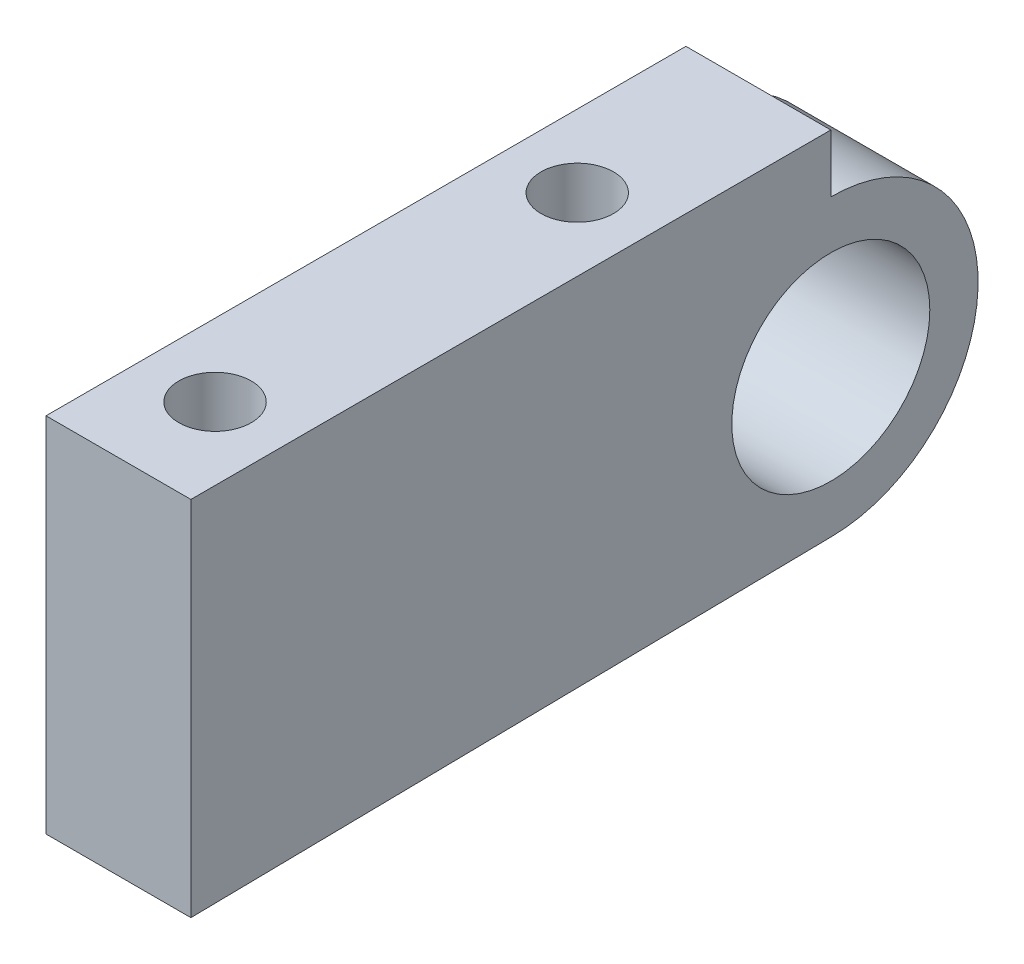
ISO-10303-21;
HEADER;
FILE_DESCRIPTION(('STEP AP214'),'2;1');
FILE_NAME('part.step','',(''),(''),'','','');
FILE_SCHEMA(('AUTOMOTIVE_DESIGN { 1 0 10303 214 1 1 1 1 }'));
ENDSEC;
DATA;
#1=APPLICATION_CONTEXT('core data for automotive mechanical design processes');
#2=APPLICATION_PROTOCOL_DEFINITION('international standard','automotive_design',2000,#1);
#3=PRODUCT_CONTEXT('',#1,'mechanical');
#4=PRODUCT('Part','Part','',(#3));
#5=PRODUCT_RELATED_PRODUCT_CATEGORY('part','',(#4));
#6=PRODUCT_DEFINITION_FORMATION('','',#4);
#7=PRODUCT_DEFINITION_CONTEXT('part definition',#1,'design');
#8=PRODUCT_DEFINITION('design','',#6,#7);
#9=PRODUCT_DEFINITION_SHAPE('','',#8);
#10=(LENGTH_UNIT() NAMED_UNIT(*) SI_UNIT(.MILLI.,.METRE.));
#11=(NAMED_UNIT(*) PLANE_ANGLE_UNIT() SI_UNIT($,.RADIAN.));
#12=(NAMED_UNIT(*) SI_UNIT($,.STERADIAN.) SOLID_ANGLE_UNIT());
#13=UNCERTAINTY_MEASURE_WITH_UNIT(LENGTH_MEASURE(1.E-05),#10,'distance_accuracy_value','');
#14=(GEOMETRIC_REPRESENTATION_CONTEXT(3) GLOBAL_UNCERTAINTY_ASSIGNED_CONTEXT((#13)) GLOBAL_UNIT_ASSIGNED_CONTEXT((#10,
#11,#12)) REPRESENTATION_CONTEXT('',''));
#15=CARTESIAN_POINT('',(0.,0.,0.));
#16=DIRECTION('',(0.,0.,1.));
#17=DIRECTION('',(1.,0.,0.));
#18=AXIS2_PLACEMENT_3D('',#15,#16,#17);
#19=CARTESIAN_POINT('',(6.,7.5,17.5));
#20=DIRECTION('',(0.,-1.,0.));
#21=DIRECTION('',(0.,0.,-1.));
#22=AXIS2_PLACEMENT_3D('',#19,#20,#21);
#23=PLANE('',#22);
#24=CARTESIAN_POINT('',(3.,7.5,13.5));
#25=DIRECTION('',(0.,1.,0.));
#26=DIRECTION('',(0.,0.,1.));
#27=AXIS2_PLACEMENT_3D('',#24,#25,#26);
#28=CIRCLE('',#27,1.5);
#29=CARTESIAN_POINT('',(3.,7.5,15.));
#30=VERTEX_POINT('',#29);
#31=EDGE_CURVE('E137',#30,#30,#28,.T.);
#32=ORIENTED_EDGE('',*,*,#31,.F.);
#33=EDGE_LOOP('',(#32));
#34=FACE_BOUND('',#33,.T.);
#35=CARTESIAN_POINT('',(3.,7.5,-1.5));
#36=DIRECTION('',(0.,1.,0.));
#37=DIRECTION('',(0.,0.,1.));
#38=AXIS2_PLACEMENT_3D('',#35,#36,#37);
#39=CIRCLE('',#38,1.5);
#40=CARTESIAN_POINT('',(3.,7.5,0.));
#41=VERTEX_POINT('',#40);
#42=EDGE_CURVE('E134',#41,#41,#39,.T.);
#43=ORIENTED_EDGE('',*,*,#42,.F.);
#44=EDGE_LOOP('',(#43));
#45=FACE_BOUND('',#44,.T.);
#46=DIRECTION('',(0.,0.,1.));
#47=VECTOR('',#46,1.);
#48=CARTESIAN_POINT('',(6.,7.5,17.5));
#49=LINE('',#48,#47);
#50=CARTESIAN_POINT('',(6.,7.5,-8.99999999999989));
#51=VERTEX_POINT('',#50);
#52=CARTESIAN_POINT('',(6.,7.5,17.5));
#53=VERTEX_POINT('',#52);
#54=EDGE_CURVE('E58',#51,#53,#49,.T.);
#55=ORIENTED_EDGE('',*,*,#54,.F.);
#56=DIRECTION('',(1.,0.,0.));
#57=VECTOR('',#56,1.);
#58=CARTESIAN_POINT('',(0.,7.5,-8.99999999999989));
#59=LINE('',#58,#57);
#60=CARTESIAN_POINT('',(0.,7.5,-8.99999999999989));
#61=VERTEX_POINT('',#60);
#62=EDGE_CURVE('E91',#61,#51,#59,.T.);
#63=ORIENTED_EDGE('',*,*,#62,.F.);
#64=DIRECTION('',(0.,0.,1.));
#65=VECTOR('',#64,1.);
#66=CARTESIAN_POINT('',(0.,7.5,17.5));
#67=LINE('',#66,#65);
#68=CARTESIAN_POINT('',(0.,7.5,17.5));
#69=VERTEX_POINT('',#68);
#70=EDGE_CURVE('E70',#61,#69,#67,.T.);
#71=ORIENTED_EDGE('',*,*,#70,.T.);
#72=DIRECTION('',(-1.,0.,0.));
#73=VECTOR('',#72,1.);
#74=CARTESIAN_POINT('',(6.,7.5,17.5));
#75=LINE('',#74,#73);
#76=EDGE_CURVE('E11',#53,#69,#75,.T.);
#77=ORIENTED_EDGE('',*,*,#76,.F.);
#78=EDGE_LOOP('',(#55,#63,#71,#77));
#79=FACE_BOUND('',#78,.T.);
#80=ADVANCED_FACE('F42',(#34,#45,#79),#23,.F.);
#81=CARTESIAN_POINT('',(6.,7.5,17.5));
#82=DIRECTION('',(0.,0.,-1.));
#83=DIRECTION('',(-1.,0.,0.));
#84=AXIS2_PLACEMENT_3D('',#81,#82,#83);
#85=PLANE('',#84);
#86=DIRECTION('',(0.,-1.,0.));
#87=VECTOR('',#86,1.);
#88=CARTESIAN_POINT('',(0.,7.5,17.5));
#89=LINE('',#88,#87);
#90=CARTESIAN_POINT('',(0.,-7.5,17.5));
#91=VERTEX_POINT('',#90);
#92=EDGE_CURVE('E144',#69,#91,#89,.T.);
#93=ORIENTED_EDGE('',*,*,#92,.T.);
#94=DIRECTION('',(-1.,0.,0.));
#95=VECTOR('',#94,1.);
#96=CARTESIAN_POINT('',(6.,-7.5,17.5));
#97=LINE('',#96,#95);
#98=CARTESIAN_POINT('',(6.,-7.5,17.5));
#99=VERTEX_POINT('',#98);
#100=EDGE_CURVE('E51',#99,#91,#97,.T.);
#101=ORIENTED_EDGE('',*,*,#100,.F.);
#102=DIRECTION('',(0.,-1.,0.));
#103=VECTOR('',#102,1.);
#104=CARTESIAN_POINT('',(6.,7.5,17.5));
#105=LINE('',#104,#103);
#106=EDGE_CURVE('E143',#53,#99,#105,.T.);
#107=ORIENTED_EDGE('',*,*,#106,.F.);
#108=ORIENTED_EDGE('',*,*,#76,.T.);
#109=EDGE_LOOP('',(#93,#101,#107,#108));
#110=FACE_BOUND('',#109,.T.);
#111=ADVANCED_FACE('F149',(#110),#85,.F.);
#112=CARTESIAN_POINT('',(6.,0.,0.));
#113=DIRECTION('',(1.,0.,0.));
#114=DIRECTION('',(0.,0.,-1.));
#115=AXIS2_PLACEMENT_3D('',#112,#113,#114);
#116=PLANE('',#115);
#117=DIRECTION('',(0.,-1.,0.));
#118=VECTOR('',#117,1.);
#119=CARTESIAN_POINT('',(6.,5.1,-8.99999999999989));
#120=LINE('',#119,#118);
#121=CARTESIAN_POINT('',(6.,5.1,-8.99999999999989));
#122=VERTEX_POINT('',#121);
#123=EDGE_CURVE('E117',#51,#122,#120,.T.);
#124=ORIENTED_EDGE('',*,*,#123,.F.);
#125=ORIENTED_EDGE('',*,*,#54,.T.);
#126=ORIENTED_EDGE('',*,*,#106,.T.);
#127=DIRECTION('',(0.,-0.0150664984963437,0.999886493869709));
#128=VECTOR('',#127,1.);
#129=CARTESIAN_POINT('',(6.,-7.5,17.5));
#130=LINE('',#129,#128);
#131=CARTESIAN_POINT('',(6.,-7.09930761260523,-9.09190564082759));
#132=VERTEX_POINT('',#131);
#133=EDGE_CURVE('E119',#132,#99,#130,.T.);
#134=ORIENTED_EDGE('',*,*,#133,.F.);
#135=CARTESIAN_POINT('',(6.,-1.,-8.99999999999989));
#136=DIRECTION('',(-1.,0.,0.));
#137=DIRECTION('',(0.,0.,-1.));
#138=AXIS2_PLACEMENT_3D('',#135,#136,#137);
#139=CIRCLE('',#138,6.1);
#140=EDGE_CURVE('E102',#122,#132,#139,.T.);
#141=ORIENTED_EDGE('',*,*,#140,.F.);
#142=EDGE_LOOP('',(#124,#125,#126,#134,#141));
#143=FACE_BOUND('',#142,.T.);
#144=CARTESIAN_POINT('',(6.,-1.,-8.99999999999989));
#145=DIRECTION('',(1.,0.,0.));
#146=DIRECTION('',(0.,0.,-1.));
#147=AXIS2_PLACEMENT_3D('',#144,#145,#146);
#148=CIRCLE('',#147,4.1);
#149=CARTESIAN_POINT('',(6.,-1.,-13.0999999999999));
#150=VERTEX_POINT('',#149);
#151=EDGE_CURVE('E130',#150,#150,#148,.T.);
#152=ORIENTED_EDGE('',*,*,#151,.F.);
#153=EDGE_LOOP('',(#152));
#154=FACE_BOUND('',#153,.T.);
#155=ADVANCED_FACE('F156',(#143,#154),#116,.T.);
#156=CARTESIAN_POINT('',(0.,0.,0.));
#157=DIRECTION('',(1.,0.,0.));
#158=DIRECTION('',(0.,0.,-1.));
#159=AXIS2_PLACEMENT_3D('',#156,#157,#158);
#160=PLANE('',#159);
#161=CARTESIAN_POINT('',(0.,-1.,-8.99999999999989));
#162=DIRECTION('',(1.,0.,0.));
#163=DIRECTION('',(0.,0.,-1.));
#164=AXIS2_PLACEMENT_3D('',#161,#162,#163);
#165=CIRCLE('',#164,4.1);
#166=CARTESIAN_POINT('',(0.,-1.,-13.0999999999999));
#167=VERTEX_POINT('',#166);
#168=EDGE_CURVE('E131',#167,#167,#165,.T.);
#169=ORIENTED_EDGE('',*,*,#168,.T.);
#170=EDGE_LOOP('',(#169));
#171=FACE_BOUND('',#170,.T.);
#172=ORIENTED_EDGE('',*,*,#70,.F.);
#173=DIRECTION('',(0.,-1.,0.));
#174=VECTOR('',#173,1.);
#175=CARTESIAN_POINT('',(0.,5.1,-8.99999999999989));
#176=LINE('',#175,#174);
#177=CARTESIAN_POINT('',(0.,5.1,-8.99999999999989));
#178=VERTEX_POINT('',#177);
#179=EDGE_CURVE('E105',#61,#178,#176,.T.);
#180=ORIENTED_EDGE('',*,*,#179,.T.);
#181=CARTESIAN_POINT('',(0.,-1.,-8.99999999999989));
#182=DIRECTION('',(-1.,0.,0.));
#183=DIRECTION('',(0.,0.,-1.));
#184=AXIS2_PLACEMENT_3D('',#181,#182,#183);
#185=CIRCLE('',#184,6.1);
#186=CARTESIAN_POINT('',(0.,-7.09930761260523,-9.09190564082759));
#187=VERTEX_POINT('',#186);
#188=EDGE_CURVE('E99',#178,#187,#185,.T.);
#189=ORIENTED_EDGE('',*,*,#188,.T.);
#190=DIRECTION('',(0.,-0.0150664984963437,0.999886493869709));
#191=VECTOR('',#190,1.);
#192=CARTESIAN_POINT('',(0.,-7.5,17.5));
#193=LINE('',#192,#191);
#194=EDGE_CURVE('E108',#187,#91,#193,.T.);
#195=ORIENTED_EDGE('',*,*,#194,.T.);
#196=ORIENTED_EDGE('',*,*,#92,.F.);
#197=EDGE_LOOP('',(#172,#180,#189,#195,#196));
#198=FACE_BOUND('',#197,.T.);
#199=ADVANCED_FACE('F116',(#171,#198),#160,.F.);
#200=CARTESIAN_POINT('',(3.,-7.5,-1.5));
#201=DIRECTION('',(0.,1.,0.));
#202=DIRECTION('',(0.,0.,1.));
#203=AXIS2_PLACEMENT_3D('',#200,#201,#202);
#204=CYLINDRICAL_SURFACE('',#203,1.5);
#205=CARTESIAN_POINT('',(3.,-7.21370403222205,-1.5));
#206=DIRECTION('',(0.,0.999886493869709,0.0150664984963437));
#207=DIRECTION('',(0.,0.0150664984963437,-0.999886493869709));
#208=AXIS2_PLACEMENT_3D('',#205,#206,#207);
#209=ELLIPSE('',#208,1.50017027852309,1.5);
#210=CARTESIAN_POINT('',(3.,-7.19110171897642,-3.));
#211=VERTEX_POINT('',#210);
#212=EDGE_CURVE('E127',#211,#211,#209,.F.);
#213=ORIENTED_EDGE('',*,*,#212,.T.);
#214=EDGE_LOOP('',(#213));
#215=FACE_BOUND('',#214,.T.);
#216=ORIENTED_EDGE('',*,*,#42,.T.);
#217=EDGE_LOOP('',(#216));
#218=FACE_BOUND('',#217,.T.);
#219=ADVANCED_FACE('F161',(#215,#218),#204,.F.);
#220=CARTESIAN_POINT('',(3.,-7.5,13.5));
#221=DIRECTION('',(0.,1.,0.));
#222=DIRECTION('',(0.,0.,1.));
#223=AXIS2_PLACEMENT_3D('',#220,#221,#222);
#224=CYLINDRICAL_SURFACE('',#223,1.5);
#225=CARTESIAN_POINT('',(3.,-7.43972716467833,13.5));
#226=DIRECTION('',(0.,0.999886493869709,0.0150664984963437));
#227=DIRECTION('',(0.,0.0150664984963437,-0.999886493869709));
#228=AXIS2_PLACEMENT_3D('',#225,#226,#227);
#229=ELLIPSE('',#228,1.50017027852309,1.5);
#230=CARTESIAN_POINT('',(3.,-7.4171248514327,12.));
#231=VERTEX_POINT('',#230);
#232=EDGE_CURVE('E45',#231,#231,#229,.F.);
#233=ORIENTED_EDGE('',*,*,#232,.T.);
#234=EDGE_LOOP('',(#233));
#235=FACE_BOUND('',#234,.T.);
#236=ORIENTED_EDGE('',*,*,#31,.T.);
#237=EDGE_LOOP('',(#236));
#238=FACE_BOUND('',#237,.T.);
#239=ADVANCED_FACE('F163',(#235,#238),#224,.F.);
#240=CARTESIAN_POINT('',(0.,-1.,-8.99999999999989));
#241=DIRECTION('',(1.,0.,0.));
#242=DIRECTION('',(0.,0.,-1.));
#243=AXIS2_PLACEMENT_3D('',#240,#241,#242);
#244=CYLINDRICAL_SURFACE('',#243,4.1);
#245=ORIENTED_EDGE('',*,*,#168,.F.);
#246=EDGE_LOOP('',(#245));
#247=FACE_BOUND('',#246,.T.);
#248=ORIENTED_EDGE('',*,*,#151,.T.);
#249=EDGE_LOOP('',(#248));
#250=FACE_BOUND('',#249,.T.);
#251=ADVANCED_FACE('F170',(#247,#250),#244,.F.);
#252=CARTESIAN_POINT('',(0.,-7.5,17.5));
#253=DIRECTION('',(0.,0.999886493869709,0.0150664984963437));
#254=DIRECTION('',(0.,-0.0150664984963437,0.999886493869709));
#255=AXIS2_PLACEMENT_3D('',#252,#253,#254);
#256=PLANE('',#255);
#257=ORIENTED_EDGE('',*,*,#232,.F.);
#258=EDGE_LOOP('',(#257));
#259=FACE_BOUND('',#258,.T.);
#260=ORIENTED_EDGE('',*,*,#133,.T.);
#261=ORIENTED_EDGE('',*,*,#100,.T.);
#262=ORIENTED_EDGE('',*,*,#194,.F.);
#263=DIRECTION('',(1.,0.,0.));
#264=VECTOR('',#263,1.);
#265=CARTESIAN_POINT('',(0.,-7.09930761260523,-9.09190564082759));
#266=LINE('',#265,#264);
#267=EDGE_CURVE('E95',#187,#132,#266,.T.);
#268=ORIENTED_EDGE('',*,*,#267,.T.);
#269=EDGE_LOOP('',(#260,#261,#262,#268));
#270=FACE_BOUND('',#269,.T.);
#271=ORIENTED_EDGE('',*,*,#212,.F.);
#272=EDGE_LOOP('',(#271));
#273=FACE_BOUND('',#272,.T.);
#274=ADVANCED_FACE('F109',(#259,#270,#273),#256,.F.);
#275=CARTESIAN_POINT('',(0.,-1.,-8.99999999999989));
#276=DIRECTION('',(1.,0.,0.));
#277=DIRECTION('',(0.,0.,-1.));
#278=AXIS2_PLACEMENT_3D('',#275,#276,#277);
#279=CYLINDRICAL_SURFACE('',#278,6.1);
#280=ORIENTED_EDGE('',*,*,#140,.T.);
#281=ORIENTED_EDGE('',*,*,#267,.F.);
#282=ORIENTED_EDGE('',*,*,#188,.F.);
#283=DIRECTION('',(1.,0.,0.));
#284=VECTOR('',#283,1.);
#285=CARTESIAN_POINT('',(0.,5.1,-8.99999999999989));
#286=LINE('',#285,#284);
#287=EDGE_CURVE('E78',#178,#122,#286,.T.);
#288=ORIENTED_EDGE('',*,*,#287,.T.);
#289=EDGE_LOOP('',(#280,#281,#282,#288));
#290=FACE_BOUND('',#289,.T.);
#291=ADVANCED_FACE('F97',(#290),#279,.T.);
#292=CARTESIAN_POINT('',(0.,5.1,-8.99999999999989));
#293=DIRECTION('',(0.,0.,1.));
#294=DIRECTION('',(1.,0.,0.));
#295=AXIS2_PLACEMENT_3D('',#292,#293,#294);
#296=PLANE('',#295);
#297=ORIENTED_EDGE('',*,*,#123,.T.);
#298=ORIENTED_EDGE('',*,*,#287,.F.);
#299=ORIENTED_EDGE('',*,*,#179,.F.);
#300=ORIENTED_EDGE('',*,*,#62,.T.);
#301=EDGE_LOOP('',(#297,#298,#299,#300));
#302=FACE_BOUND('',#301,.T.);
#303=ADVANCED_FACE('F193',(#302),#296,.F.);
#304=CLOSED_SHELL('',(#80,#111,#155,#199,#219,#239,#251,#274,#291,#303));
#305=MANIFOLD_SOLID_BREP('B2',#304);
#306=ADVANCED_BREP_SHAPE_REPRESENTATION('',(#18,#305),#14);
#307=SHAPE_DEFINITION_REPRESENTATION(#9,#306);
ENDSEC;
END-ISO-10303-21;
